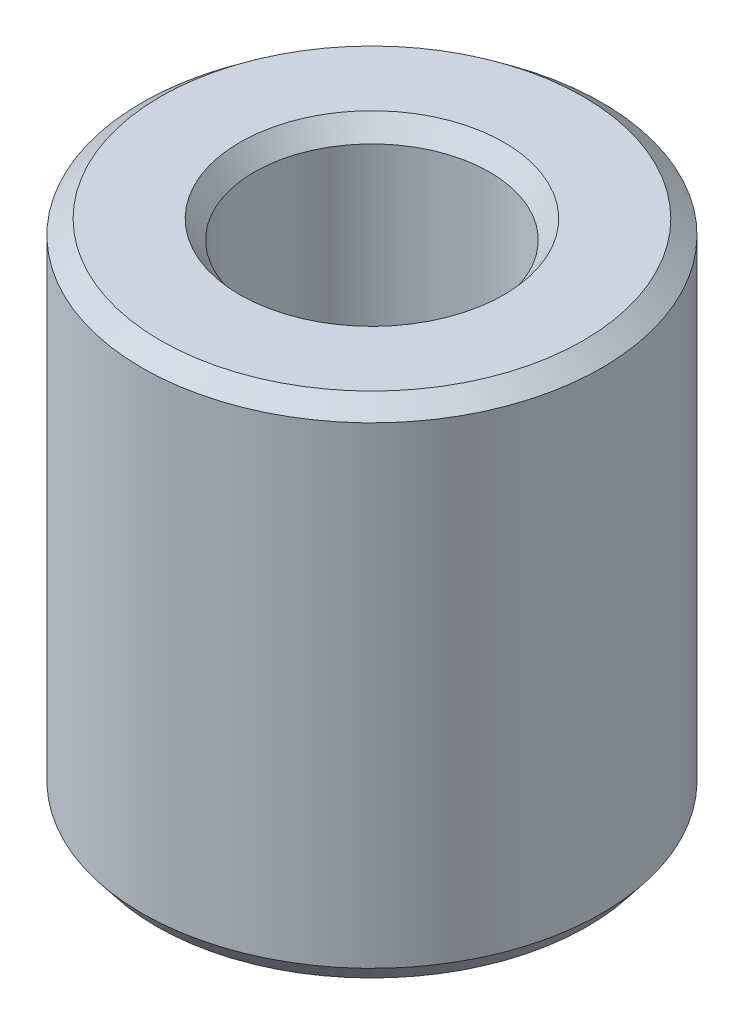
ISO-10303-21;
HEADER;
FILE_DESCRIPTION(('STEP AP214'),'2;1');
FILE_NAME('part.step','',(''),(''),'','','');
FILE_SCHEMA(('AUTOMOTIVE_DESIGN { 1 0 10303 214 1 1 1 1 }'));
ENDSEC;
DATA;
#1=APPLICATION_CONTEXT('core data for automotive mechanical design processes');
#2=APPLICATION_PROTOCOL_DEFINITION('international standard','automotive_design',2000,#1);
#3=PRODUCT_CONTEXT('',#1,'mechanical');
#4=PRODUCT('Part','Part','',(#3));
#5=PRODUCT_RELATED_PRODUCT_CATEGORY('part','',(#4));
#6=PRODUCT_DEFINITION_FORMATION('','',#4);
#7=PRODUCT_DEFINITION_CONTEXT('part definition',#1,'design');
#8=PRODUCT_DEFINITION('design','',#6,#7);
#9=PRODUCT_DEFINITION_SHAPE('','',#8);
#10=(LENGTH_UNIT() NAMED_UNIT(*) SI_UNIT(.MILLI.,.METRE.));
#11=(NAMED_UNIT(*) PLANE_ANGLE_UNIT() SI_UNIT($,.RADIAN.));
#12=(NAMED_UNIT(*) SI_UNIT($,.STERADIAN.) SOLID_ANGLE_UNIT());
#13=UNCERTAINTY_MEASURE_WITH_UNIT(LENGTH_MEASURE(1.E-05),#10,'distance_accuracy_value','');
#14=(GEOMETRIC_REPRESENTATION_CONTEXT(3) GLOBAL_UNCERTAINTY_ASSIGNED_CONTEXT((#13)) GLOBAL_UNIT_ASSIGNED_CONTEXT((#10,
#11,#12)) REPRESENTATION_CONTEXT('',''));
#15=CARTESIAN_POINT('',(0.,0.,0.));
#16=DIRECTION('',(0.,0.,1.));
#17=DIRECTION('',(1.,0.,0.));
#18=AXIS2_PLACEMENT_3D('',#15,#16,#17);
#19=CARTESIAN_POINT('',(0.,10.9929366217314,0.));
#20=DIRECTION('',(0.,-1.,0.));
#21=DIRECTION('',(0.,0.,-1.));
#22=AXIS2_PLACEMENT_3D('',#19,#20,#21);
#23=CYLINDRICAL_SURFACE('',#22,5.);
#24=CARTESIAN_POINT('',(0.,0.403020658212029,0.));
#25=DIRECTION('',(0.,1.,0.));
#26=DIRECTION('',(0.,0.,1.));
#27=AXIS2_PLACEMENT_3D('',#24,#25,#26);
#28=CIRCLE('',#27,5.);
#29=CARTESIAN_POINT('',(0.,0.403020658212029,5.));
#30=VERTEX_POINT('',#29);
#31=EDGE_CURVE('E10',#30,#30,#28,.T.);
#32=ORIENTED_EDGE('',*,*,#31,.T.);
#33=EDGE_LOOP('',(#32));
#34=FACE_BOUND('',#33,.T.);
#35=CARTESIAN_POINT('',(0.,10.6791145305067,0.));
#36=DIRECTION('',(0.,1.,0.));
#37=DIRECTION('',(0.,0.,1.));
#38=AXIS2_PLACEMENT_3D('',#35,#36,#37);
#39=CIRCLE('',#38,5.);
#40=CARTESIAN_POINT('',(0.,10.6791145305067,5.));
#41=VERTEX_POINT('',#40);
#42=EDGE_CURVE('E50',#41,#41,#39,.F.);
#43=ORIENTED_EDGE('',*,*,#42,.T.);
#44=EDGE_LOOP('',(#43));
#45=FACE_BOUND('',#44,.T.);
#46=ADVANCED_FACE('F39',(#34,#45),#23,.T.);
#47=CARTESIAN_POINT('',(0.,10.9929366217314,0.));
#48=DIRECTION('',(0.,1.,0.));
#49=DIRECTION('',(0.,0.,1.));
#50=AXIS2_PLACEMENT_3D('',#47,#48,#49);
#51=PLANE('',#50);
#52=CARTESIAN_POINT('',(0.,10.9929366217314,0.));
#53=DIRECTION('',(0.,1.,0.));
#54=DIRECTION('',(0.,0.,1.));
#55=AXIS2_PLACEMENT_3D('',#52,#53,#54);
#56=CIRCLE('',#55,2.87308489487493);
#57=CARTESIAN_POINT('',(0.,10.9929366217314,2.87308489487493));
#58=VERTEX_POINT('',#57);
#59=EDGE_CURVE('E58',#58,#58,#56,.F.);
#60=ORIENTED_EDGE('',*,*,#59,.T.);
#61=EDGE_LOOP('',(#60));
#62=FACE_BOUND('',#61,.T.);
#63=CARTESIAN_POINT('',(0.,10.9929366217314,0.));
#64=DIRECTION('',(0.,1.,0.));
#65=DIRECTION('',(0.,0.,1.));
#66=AXIS2_PLACEMENT_3D('',#63,#64,#65);
#67=CIRCLE('',#66,4.59697934178797);
#68=CARTESIAN_POINT('',(0.,10.9929366217314,4.59697934178797));
#69=VERTEX_POINT('',#68);
#70=EDGE_CURVE('E61',#69,#69,#67,.T.);
#71=ORIENTED_EDGE('',*,*,#70,.T.);
#72=EDGE_LOOP('',(#71));
#73=FACE_BOUND('',#72,.T.);
#74=ADVANCED_FACE('F88',(#62,#73),#51,.T.);
#75=CARTESIAN_POINT('',(0.,0.,0.));
#76=DIRECTION('',(0.,1.,0.));
#77=DIRECTION('',(0.,0.,1.));
#78=AXIS2_PLACEMENT_3D('',#75,#76,#77);
#79=PLANE('',#78);
#80=CARTESIAN_POINT('',(0.,0.,0.));
#81=DIRECTION('',(0.,1.,0.));
#82=DIRECTION('',(0.,0.,1.));
#83=AXIS2_PLACEMENT_3D('',#80,#81,#82);
#84=CIRCLE('',#83,2.96228346186228);
#85=CARTESIAN_POINT('',(0.,0.,2.96228346186228));
#86=VERTEX_POINT('',#85);
#87=EDGE_CURVE('E51',#86,#86,#84,.T.);
#88=ORIENTED_EDGE('',*,*,#87,.T.);
#89=EDGE_LOOP('',(#88));
#90=FACE_BOUND('',#89,.T.);
#91=CARTESIAN_POINT('',(0.,0.,0.));
#92=DIRECTION('',(0.,1.,0.));
#93=DIRECTION('',(0.,0.,1.));
#94=AXIS2_PLACEMENT_3D('',#91,#92,#93);
#95=CIRCLE('',#94,4.68617790877533);
#96=CARTESIAN_POINT('',(0.,0.,4.68617790877533));
#97=VERTEX_POINT('',#96);
#98=EDGE_CURVE('E54',#97,#97,#95,.F.);
#99=ORIENTED_EDGE('',*,*,#98,.T.);
#100=EDGE_LOOP('',(#99));
#101=FACE_BOUND('',#100,.T.);
#102=ADVANCED_FACE('F83',(#90,#101),#79,.F.);
#103=CARTESIAN_POINT('',(0.,10.9929366217314,0.));
#104=DIRECTION('',(0.,-1.,0.));
#105=DIRECTION('',(0.,0.,-1.));
#106=AXIS2_PLACEMENT_3D('',#103,#104,#105);
#107=CYLINDRICAL_SURFACE('',#106,2.55926280365025);
#108=CARTESIAN_POINT('',(0.,10.5899159635194,0.));
#109=DIRECTION('',(0.,1.,0.));
#110=DIRECTION('',(0.,0.,1.));
#111=AXIS2_PLACEMENT_3D('',#108,#109,#110);
#112=CIRCLE('',#111,2.55926280365025);
#113=CARTESIAN_POINT('',(0.,10.5899159635194,2.55926280365025));
#114=VERTEX_POINT('',#113);
#115=EDGE_CURVE('E67',#114,#114,#112,.T.);
#116=ORIENTED_EDGE('',*,*,#115,.T.);
#117=EDGE_LOOP('',(#116));
#118=FACE_BOUND('',#117,.T.);
#119=CARTESIAN_POINT('',(0.,0.31382209122467,0.));
#120=DIRECTION('',(0.,1.,0.));
#121=DIRECTION('',(0.,0.,1.));
#122=AXIS2_PLACEMENT_3D('',#119,#120,#121);
#123=CIRCLE('',#122,2.55926280365025);
#124=CARTESIAN_POINT('',(0.,0.31382209122467,2.55926280365025));
#125=VERTEX_POINT('',#124);
#126=EDGE_CURVE('E69',#125,#125,#123,.F.);
#127=ORIENTED_EDGE('',*,*,#126,.T.);
#128=EDGE_LOOP('',(#127));
#129=FACE_BOUND('',#128,.T.);
#130=ADVANCED_FACE('F71',(#118,#129),#107,.F.);
#131=CARTESIAN_POINT('',(0.,10.5899159635194,0.));
#132=DIRECTION('',(0.,1.,0.));
#133=DIRECTION('',(0.,0.,1.));
#134=AXIS2_PLACEMENT_3D('',#131,#132,#133);
#135=CONICAL_SURFACE('',#134,2.55926280365025,0.661601933687707);
#136=CARTESIAN_POINT('',(0.,10.9929366217314,2.87308489487493));
#137=CARTESIAN_POINT('',(0.,10.988738489875,2.869815914758));
#138=CARTESIAN_POINT('',(0.,10.9845403580186,2.86654693464108));
#139=CARTESIAN_POINT('',(0.,10.9761440943059,2.86000897440723));
#140=CARTESIAN_POINT('',(0.,10.9719459624495,2.85673999429031));
#141=CARTESIAN_POINT('',(0.,10.9635496987368,2.85020203405646));
#142=CARTESIAN_POINT('',(0.,10.9593515668804,2.84693305393954));
#143=CARTESIAN_POINT('',(0.,10.9509553031676,2.84039509370569));
#144=CARTESIAN_POINT('',(0.,10.9467571713113,2.83712611358877));
#145=CARTESIAN_POINT('',(0.,10.9383609075985,2.83058815335492));
#146=CARTESIAN_POINT('',(0.,10.9341627757421,2.827319173238));
#147=CARTESIAN_POINT('',(0.,10.9257665120294,2.82078121300415));
#148=CARTESIAN_POINT('',(0.,10.921568380173,2.81751223288722));
#149=CARTESIAN_POINT('',(0.,10.9131721164603,2.81097427265338));
#150=CARTESIAN_POINT('',(0.,10.9089739846039,2.80770529253645));
#151=CARTESIAN_POINT('',(0.,10.9005777208911,2.80116733230261));
#152=CARTESIAN_POINT('',(0.,10.8963795890348,2.79789835218568));
#153=CARTESIAN_POINT('',(0.,10.887983325322,2.79136039195183));
#154=CARTESIAN_POINT('',(0.,10.8837851934656,2.78809141183491));
#155=CARTESIAN_POINT('',(0.,10.8753889297529,2.78155345160106));
#156=CARTESIAN_POINT('',(0.,10.8711907978965,2.77828447148414));
#157=CARTESIAN_POINT('',(0.,10.8627945341837,2.77174651125029));
#158=CARTESIAN_POINT('',(0.,10.8585964023274,2.76847753113337));
#159=CARTESIAN_POINT('',(0.,10.8502001386146,2.76193957089952));
#160=CARTESIAN_POINT('',(0.,10.8460020067582,2.7586705907826));
#161=CARTESIAN_POINT('',(0.,10.8376057430455,2.75213263054875));
#162=CARTESIAN_POINT('',(0.,10.8334076111891,2.74886365043183));
#163=CARTESIAN_POINT('',(0.,10.8250113474764,2.74232569019798));
#164=CARTESIAN_POINT('',(0.,10.82081321562,2.73905671008106));
#165=CARTESIAN_POINT('',(0.,10.8124169519072,2.73251874984721));
#166=CARTESIAN_POINT('',(0.,10.8082188200509,2.72924976973029));
#167=CARTESIAN_POINT('',(0.,10.7998225563381,2.72271180949644));
#168=CARTESIAN_POINT('',(0.,10.7956244244817,2.71944282937951));
#169=CARTESIAN_POINT('',(0.,10.787228160769,2.71290486914567));
#170=CARTESIAN_POINT('',(0.,10.7830300289126,2.70963588902874));
#171=CARTESIAN_POINT('',(0.,10.7746337651999,2.7030979287949));
#172=CARTESIAN_POINT('',(0.,10.7704356333435,2.69982894867797));
#173=CARTESIAN_POINT('',(0.,10.7620393696307,2.69329098844412));
#174=CARTESIAN_POINT('',(0.,10.7578412377744,2.6900220083272));
#175=CARTESIAN_POINT('',(0.,10.7494449740616,2.68348404809335));
#176=CARTESIAN_POINT('',(0.,10.7452468422052,2.68021506797643));
#177=CARTESIAN_POINT('',(0.,10.7368505784925,2.67367710774258));
#178=CARTESIAN_POINT('',(0.,10.7326524466361,2.67040812762566));
#179=CARTESIAN_POINT('',(0.,10.7242561829234,2.66387016739181));
#180=CARTESIAN_POINT('',(0.,10.720058051067,2.66060118727489));
#181=CARTESIAN_POINT('',(0.,10.7116617873542,2.65406322704104));
#182=CARTESIAN_POINT('',(0.,10.7074636554979,2.65079424692412));
#183=CARTESIAN_POINT('',(0.,10.6990673917851,2.64425628669027));
#184=CARTESIAN_POINT('',(0.,10.6948692599287,2.64098730657335));
#185=CARTESIAN_POINT('',(0.,10.686472996216,2.6344493463395));
#186=CARTESIAN_POINT('',(0.,10.6822748643596,2.63118036622258));
#187=CARTESIAN_POINT('',(0.,10.6738786006469,2.62464240598873));
#188=CARTESIAN_POINT('',(0.,10.6696804687905,2.6213734258718));
#189=CARTESIAN_POINT('',(0.,10.6612842050777,2.61483546563796));
#190=CARTESIAN_POINT('',(0.,10.6570860732214,2.61156648552103));
#191=CARTESIAN_POINT('',(0.,10.6486898095086,2.60502852528719));
#192=CARTESIAN_POINT('',(0.,10.6444916776522,2.60175954517026));
#193=CARTESIAN_POINT('',(0.,10.6360954139395,2.59522158493641));
#194=CARTESIAN_POINT('',(0.,10.6318972820831,2.59195260481949));
#195=CARTESIAN_POINT('',(0.,10.6235010183704,2.58541464458564));
#196=CARTESIAN_POINT('',(0.,10.619302886514,2.58214566446872));
#197=CARTESIAN_POINT('',(0.,10.6109066228012,2.57560770423487));
#198=CARTESIAN_POINT('',(0.,10.6067084909449,2.57233872411795));
#199=CARTESIAN_POINT('',(0.,10.5983122272321,2.5658007638841));
#200=CARTESIAN_POINT('',(0.,10.5941140953757,2.56253178376718));
#201=CARTESIAN_POINT('',(0.,10.5899159635194,2.55926280365025));
#202=B_SPLINE_CURVE_WITH_KNOTS('',3,(#136,#137,#138,#139,#140,#141,#142,#143,#144,#145,#146,
#147,#148,#149,#150,#151,#152,#153,#154,#155,#156,#157,#158,#159,#160,#161,#162,#163,#164,#165,
#166,#167,#168,#169,#170,#171,#172,#173,#174,#175,#176,#177,#178,#179,#180,#181,#182,#183,#184,
#185,#186,#187,#188,#189,#190,#191,#192,#193,#194,#195,#196,#197,#198,#199,#200,#201),
.UNSPECIFIED.,.F.,.F.,(4,2,2,2,2,2,2,2,2,2,2,2,2,2,2,2,2,2,2,2,2,2,2,2,2,2,2,2,2,2,2,2,4),(0.,
0.0159622955365208,0.0319245910730403,0.0478868866095597,0.0638491821460794,0.0798114776825986,
0.0957737732191184,0.111736068755638,0.127698364292157,0.143660659828678,0.159622955365198,
0.175585250901717,0.191547546438236,0.207509841974756,0.223472137511275,0.239434433047795,
0.255396728584314,0.271359024120835,0.287321319657355,0.303283615193874,0.319245910730393,
0.335208206266913,0.351170501803432,0.367132797339952,0.383095092876473,0.399057388412992,
0.415019683949512,0.430981979486031,0.446944275022551,0.46290657055907,0.47886886609559,
0.494831161632109,0.510793457168629),.UNSPECIFIED.);
#203=EDGE_CURVE('BSEAM77',#58,#114,#202,.T.);
#204=ORIENTED_EDGE('',*,*,#59,.F.);
#205=ORIENTED_EDGE('',*,*,#115,.F.);
#206=ORIENTED_EDGE('',*,*,#203,.T.);
#207=ORIENTED_EDGE('',*,*,#203,.F.);
#208=EDGE_LOOP('',(#204,#206,#205,#207));
#209=FACE_BOUND('',#208,.T.);
#210=ADVANCED_FACE('F77',(#209),#135,.F.);
#211=CARTESIAN_POINT('',(0.,0.,0.));
#212=DIRECTION('',(0.,-1.,0.));
#213=DIRECTION('',(0.,0.,-1.));
#214=AXIS2_PLACEMENT_3D('',#211,#212,#213);
#215=CONICAL_SURFACE('',#214,2.96228346186228,0.909194393107191);
#216=ORIENTED_EDGE('',*,*,#126,.F.);
#217=EDGE_LOOP('',(#216));
#218=FACE_BOUND('',#217,.T.);
#219=ORIENTED_EDGE('',*,*,#87,.F.);
#220=EDGE_LOOP('',(#219));
#221=FACE_BOUND('',#220,.T.);
#222=ADVANCED_FACE('F73',(#218,#221),#215,.F.);
#223=CARTESIAN_POINT('',(0.,0.403020658212029,0.));
#224=DIRECTION('',(0.,1.,0.));
#225=DIRECTION('',(0.,0.,1.));
#226=AXIS2_PLACEMENT_3D('',#223,#224,#225);
#227=CONICAL_SURFACE('',#226,5.,0.661601933687704);
#228=ORIENTED_EDGE('',*,*,#98,.F.);
#229=EDGE_LOOP('',(#228));
#230=FACE_BOUND('',#229,.T.);
#231=ORIENTED_EDGE('',*,*,#31,.F.);
#232=EDGE_LOOP('',(#231));
#233=FACE_BOUND('',#232,.T.);
#234=ADVANCED_FACE('F76',(#230,#233),#227,.T.);
#235=CARTESIAN_POINT('',(0.,10.9929366217314,0.));
#236=DIRECTION('',(0.,-1.,0.));
#237=DIRECTION('',(0.,0.,-1.));
#238=AXIS2_PLACEMENT_3D('',#235,#236,#237);
#239=CONICAL_SURFACE('',#238,4.59697934178797,0.909194393107197);
#240=ORIENTED_EDGE('',*,*,#42,.F.);
#241=EDGE_LOOP('',(#240));
#242=FACE_BOUND('',#241,.T.);
#243=ORIENTED_EDGE('',*,*,#70,.F.);
#244=EDGE_LOOP('',(#243));
#245=FACE_BOUND('',#244,.T.);
#246=ADVANCED_FACE('F45',(#242,#245),#239,.T.);
#247=CLOSED_SHELL('',(#46,#74,#102,#130,#210,#222,#234,#246));
#248=MANIFOLD_SOLID_BREP('B2',#247);
#249=ADVANCED_BREP_SHAPE_REPRESENTATION('',(#18,#248),#14);
#250=SHAPE_DEFINITION_REPRESENTATION(#9,#249);
ENDSEC;
END-ISO-10303-21;
